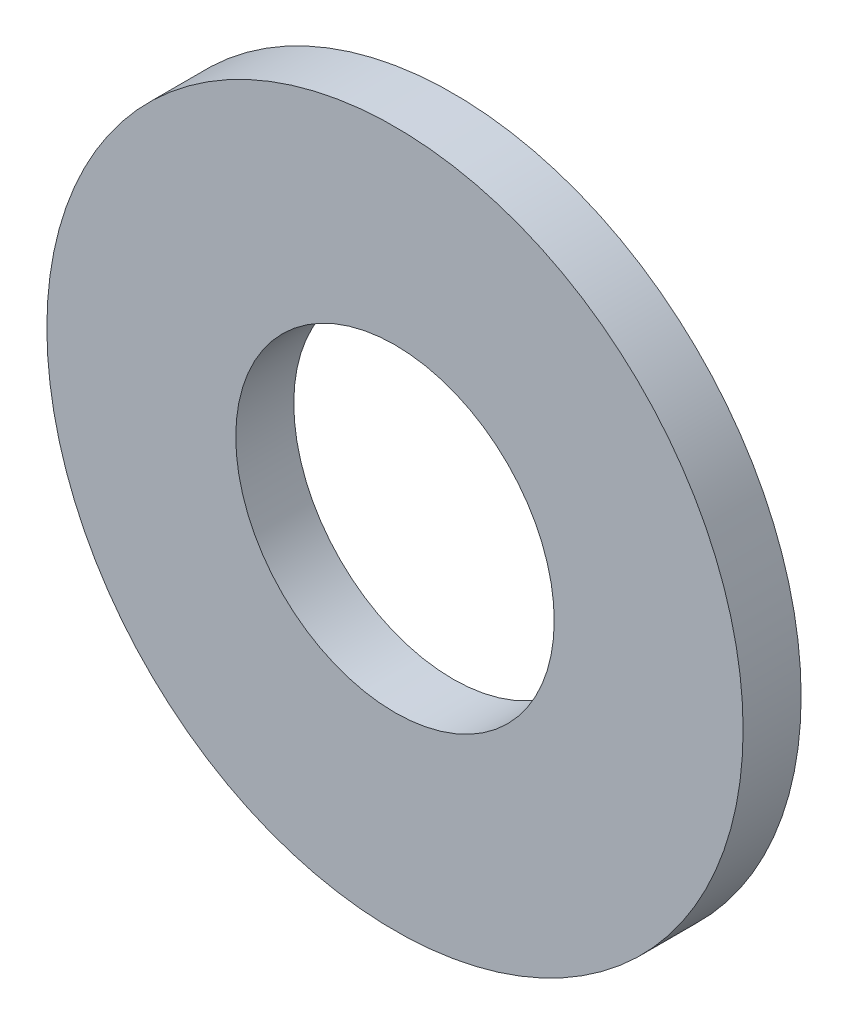
ISO-10303-21;
HEADER;
FILE_DESCRIPTION(('STEP AP214'),'2;1');
FILE_NAME('part.step','',(''),(''),'','','');
FILE_SCHEMA(('AUTOMOTIVE_DESIGN { 1 0 10303 214 1 1 1 1 }'));
ENDSEC;
DATA;
#1=APPLICATION_CONTEXT('core data for automotive mechanical design processes');
#2=APPLICATION_PROTOCOL_DEFINITION('international standard','automotive_design',2000,#1);
#3=PRODUCT_CONTEXT('',#1,'mechanical');
#4=PRODUCT('Part','Part','',(#3));
#5=PRODUCT_RELATED_PRODUCT_CATEGORY('part','',(#4));
#6=PRODUCT_DEFINITION_FORMATION('','',#4);
#7=PRODUCT_DEFINITION_CONTEXT('part definition',#1,'design');
#8=PRODUCT_DEFINITION('design','',#6,#7);
#9=PRODUCT_DEFINITION_SHAPE('','',#8);
#10=(LENGTH_UNIT() NAMED_UNIT(*) SI_UNIT(.MILLI.,.METRE.));
#11=(NAMED_UNIT(*) PLANE_ANGLE_UNIT() SI_UNIT($,.RADIAN.));
#12=(NAMED_UNIT(*) SI_UNIT($,.STERADIAN.) SOLID_ANGLE_UNIT());
#13=UNCERTAINTY_MEASURE_WITH_UNIT(LENGTH_MEASURE(1.E-05),#10,'distance_accuracy_value','');
#14=(GEOMETRIC_REPRESENTATION_CONTEXT(3) GLOBAL_UNCERTAINTY_ASSIGNED_CONTEXT((#13)) GLOBAL_UNIT_ASSIGNED_CONTEXT((#10,
#11,#12)) REPRESENTATION_CONTEXT('',''));
#15=CARTESIAN_POINT('',(0.,0.,0.));
#16=DIRECTION('',(0.,0.,1.));
#17=DIRECTION('',(1.,0.,0.));
#18=AXIS2_PLACEMENT_3D('',#15,#16,#17);
#19=CARTESIAN_POINT('',(-2.79526486874285,-4.70072561982278,0.75));
#20=DIRECTION('',(0.,0.,1.));
#21=DIRECTION('',(1.,0.,0.));
#22=AXIS2_PLACEMENT_3D('',#19,#20,#21);
#23=PLANE('',#22);
#24=CARTESIAN_POINT('',(-2.79526486874285,-4.70072561982278,0.75));
#25=DIRECTION('',(0.,0.,1.));
#26=DIRECTION('',(1.,0.,0.));
#27=AXIS2_PLACEMENT_3D('',#24,#25,#26);
#28=CIRCLE('',#27,4.5);
#29=CARTESIAN_POINT('',(1.70473513125715,-4.70072561982278,0.75));
#30=VERTEX_POINT('',#29);
#31=EDGE_CURVE('E10',#30,#30,#28,.T.);
#32=ORIENTED_EDGE('',*,*,#31,.T.);
#33=EDGE_LOOP('',(#32));
#34=FACE_BOUND('',#33,.T.);
#35=CARTESIAN_POINT('',(-2.79526486874285,-4.70072561982278,0.75));
#36=DIRECTION('',(0.,0.,1.));
#37=DIRECTION('',(1.,0.,0.));
#38=AXIS2_PLACEMENT_3D('',#35,#36,#37);
#39=CIRCLE('',#38,2.05834917842844);
#40=CARTESIAN_POINT('',(-0.736915690314418,-4.70072561982278,0.75));
#41=VERTEX_POINT('',#40);
#42=EDGE_CURVE('E43',#41,#41,#39,.T.);
#43=ORIENTED_EDGE('',*,*,#42,.F.);
#44=EDGE_LOOP('',(#43));
#45=FACE_BOUND('',#44,.T.);
#46=ADVANCED_FACE('F32',(#34,#45),#23,.T.);
#47=CARTESIAN_POINT('',(-2.79526486874285,-4.70072561982278,0.));
#48=DIRECTION('',(0.,0.,1.));
#49=DIRECTION('',(1.,0.,0.));
#50=AXIS2_PLACEMENT_3D('',#47,#48,#49);
#51=PLANE('',#50);
#52=CARTESIAN_POINT('',(-2.79526486874285,-4.70072561982278,0.));
#53=DIRECTION('',(0.,0.,1.));
#54=DIRECTION('',(1.,0.,0.));
#55=AXIS2_PLACEMENT_3D('',#52,#53,#54);
#56=CIRCLE('',#55,4.5);
#57=CARTESIAN_POINT('',(1.70473513125715,-4.70072561982278,0.));
#58=VERTEX_POINT('',#57);
#59=EDGE_CURVE('E36',#58,#58,#56,.T.);
#60=ORIENTED_EDGE('',*,*,#59,.F.);
#61=EDGE_LOOP('',(#60));
#62=FACE_BOUND('',#61,.T.);
#63=CARTESIAN_POINT('',(-2.79526486874285,-4.70072561982278,0.));
#64=DIRECTION('',(0.,0.,1.));
#65=DIRECTION('',(1.,0.,0.));
#66=AXIS2_PLACEMENT_3D('',#63,#64,#65);
#67=CIRCLE('',#66,2.05834917842844);
#68=CARTESIAN_POINT('',(-0.736915690314418,-4.70072561982278,0.));
#69=VERTEX_POINT('',#68);
#70=EDGE_CURVE('E45',#69,#69,#67,.T.);
#71=ORIENTED_EDGE('',*,*,#70,.T.);
#72=EDGE_LOOP('',(#71));
#73=FACE_BOUND('',#72,.T.);
#74=ADVANCED_FACE('F55',(#62,#73),#51,.F.);
#75=CARTESIAN_POINT('',(-2.79526486874285,-4.70072561982278,0.75));
#76=DIRECTION('',(0.,0.,-1.));
#77=DIRECTION('',(-1.,0.,0.));
#78=AXIS2_PLACEMENT_3D('',#75,#76,#77);
#79=CYLINDRICAL_SURFACE('',#78,4.5);
#80=ORIENTED_EDGE('',*,*,#31,.F.);
#81=EDGE_LOOP('',(#80));
#82=FACE_BOUND('',#81,.T.);
#83=ORIENTED_EDGE('',*,*,#59,.T.);
#84=EDGE_LOOP('',(#83));
#85=FACE_BOUND('',#84,.T.);
#86=ADVANCED_FACE('F34',(#82,#85),#79,.T.);
#87=CARTESIAN_POINT('',(-2.79526486874285,-4.70072561982278,0.75));
#88=DIRECTION('',(0.,0.,-1.));
#89=DIRECTION('',(-1.,0.,0.));
#90=AXIS2_PLACEMENT_3D('',#87,#88,#89);
#91=CYLINDRICAL_SURFACE('',#90,2.05834917842844);
#92=ORIENTED_EDGE('',*,*,#42,.T.);
#93=EDGE_LOOP('',(#92));
#94=FACE_BOUND('',#93,.T.);
#95=ORIENTED_EDGE('',*,*,#70,.F.);
#96=EDGE_LOOP('',(#95));
#97=FACE_BOUND('',#96,.T.);
#98=ADVANCED_FACE('F51',(#94,#97),#91,.F.);
#99=CLOSED_SHELL('',(#46,#74,#86,#98));
#100=MANIFOLD_SOLID_BREP('B2',#99);
#101=ADVANCED_BREP_SHAPE_REPRESENTATION('',(#18,#100),#14);
#102=SHAPE_DEFINITION_REPRESENTATION(#9,#101);
ENDSEC;
END-ISO-10303-21;
